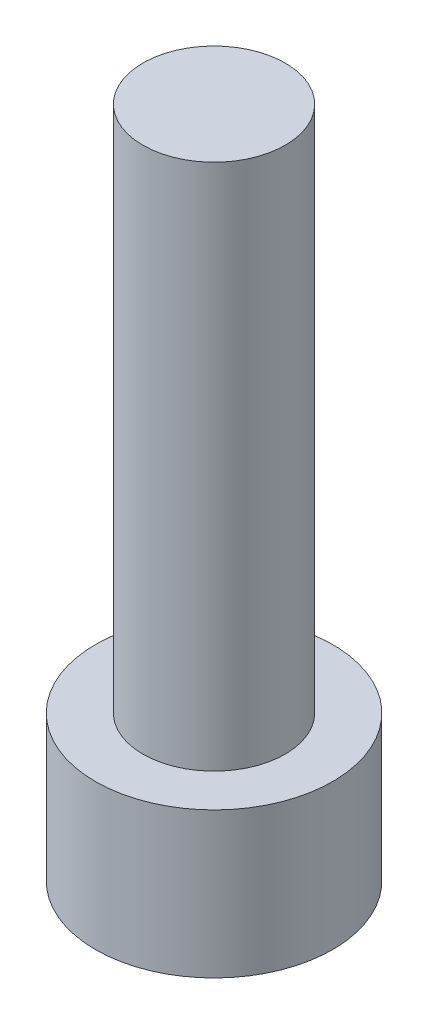
ISO-10303-21;
HEADER;
FILE_DESCRIPTION(('STEP AP214'),'2;1');
FILE_NAME('part.step','',(''),(''),'','','');
FILE_SCHEMA(('AUTOMOTIVE_DESIGN { 1 0 10303 214 1 1 1 1 }'));
ENDSEC;
DATA;
#1=APPLICATION_CONTEXT('core data for automotive mechanical design processes');
#2=APPLICATION_PROTOCOL_DEFINITION('international standard','automotive_design',2000,#1);
#3=PRODUCT_CONTEXT('',#1,'mechanical');
#4=PRODUCT('Part','Part','',(#3));
#5=PRODUCT_RELATED_PRODUCT_CATEGORY('part','',(#4));
#6=PRODUCT_DEFINITION_FORMATION('','',#4);
#7=PRODUCT_DEFINITION_CONTEXT('part definition',#1,'design');
#8=PRODUCT_DEFINITION('design','',#6,#7);
#9=PRODUCT_DEFINITION_SHAPE('','',#8);
#10=(LENGTH_UNIT() NAMED_UNIT(*) SI_UNIT(.MILLI.,.METRE.));
#11=(NAMED_UNIT(*) PLANE_ANGLE_UNIT() SI_UNIT($,.RADIAN.));
#12=(NAMED_UNIT(*) SI_UNIT($,.STERADIAN.) SOLID_ANGLE_UNIT());
#13=UNCERTAINTY_MEASURE_WITH_UNIT(LENGTH_MEASURE(1.E-05),#10,'distance_accuracy_value','');
#14=(GEOMETRIC_REPRESENTATION_CONTEXT(3) GLOBAL_UNCERTAINTY_ASSIGNED_CONTEXT((#13)) GLOBAL_UNIT_ASSIGNED_CONTEXT((#10,
#11,#12)) REPRESENTATION_CONTEXT('',''));
#15=CARTESIAN_POINT('',(0.,0.,0.));
#16=DIRECTION('',(0.,0.,1.));
#17=DIRECTION('',(1.,0.,0.));
#18=AXIS2_PLACEMENT_3D('',#15,#16,#17);
#19=CARTESIAN_POINT('',(0.,3.5052,0.));
#20=DIRECTION('',(0.,1.,0.));
#21=DIRECTION('',(0.,0.,1.));
#22=AXIS2_PLACEMENT_3D('',#19,#20,#21);
#23=PLANE('',#22);
#24=CARTESIAN_POINT('',(0.,3.5052,0.));
#25=DIRECTION('',(0.,1.,0.));
#26=DIRECTION('',(0.,0.,1.));
#27=AXIS2_PLACEMENT_3D('',#24,#25,#26);
#28=CIRCLE('',#27,2.8575);
#29=CARTESIAN_POINT('',(0.,3.5052,2.8575));
#30=VERTEX_POINT('',#29);
#31=EDGE_CURVE('E11',#30,#30,#28,.T.);
#32=ORIENTED_EDGE('',*,*,#31,.T.);
#33=EDGE_LOOP('',(#32));
#34=FACE_BOUND('',#33,.T.);
#35=CARTESIAN_POINT('',(0.,3.5052,0.));
#36=DIRECTION('',(0.,1.,0.));
#37=DIRECTION('',(0.,0.,1.));
#38=AXIS2_PLACEMENT_3D('',#35,#36,#37);
#39=CIRCLE('',#38,1.7145);
#40=CARTESIAN_POINT('',(0.,3.5052,1.7145));
#41=VERTEX_POINT('',#40);
#42=EDGE_CURVE('E152',#41,#41,#39,.T.);
#43=ORIENTED_EDGE('',*,*,#42,.F.);
#44=EDGE_LOOP('',(#43));
#45=FACE_BOUND('',#44,.T.);
#46=ADVANCED_FACE('F33',(#34,#45),#23,.T.);
#47=CARTESIAN_POINT('',(0.,3.5052,0.));
#48=DIRECTION('',(0.,-1.,0.));
#49=DIRECTION('',(0.,0.,-1.));
#50=AXIS2_PLACEMENT_3D('',#47,#48,#49);
#51=CYLINDRICAL_SURFACE('',#50,2.8575);
#52=ORIENTED_EDGE('',*,*,#31,.F.);
#53=EDGE_LOOP('',(#52));
#54=FACE_BOUND('',#53,.T.);
#55=CARTESIAN_POINT('',(0.,0.,0.));
#56=DIRECTION('',(0.,1.,0.));
#57=DIRECTION('',(0.,0.,1.));
#58=AXIS2_PLACEMENT_3D('',#55,#56,#57);
#59=CIRCLE('',#58,2.8575);
#60=CARTESIAN_POINT('',(0.,0.,2.8575));
#61=VERTEX_POINT('',#60);
#62=EDGE_CURVE('E37',#61,#61,#59,.T.);
#63=ORIENTED_EDGE('',*,*,#62,.T.);
#64=EDGE_LOOP('',(#63));
#65=FACE_BOUND('',#64,.T.);
#66=ADVANCED_FACE('F35',(#54,#65),#51,.T.);
#67=CARTESIAN_POINT('',(0.,0.,0.));
#68=DIRECTION('',(0.,1.,0.));
#69=DIRECTION('',(0.,0.,1.));
#70=AXIS2_PLACEMENT_3D('',#67,#68,#69);
#71=PLANE('',#70);
#72=DIRECTION('',(-0.500000000000001,0.,0.866025403784438));
#73=VECTOR('',#72,1.);
#74=CARTESIAN_POINT('',(1.60395121659243,0.,0.));
#75=LINE('',#74,#73);
#76=CARTESIAN_POINT('',(1.60395121659243,0.,0.));
#77=VERTEX_POINT('',#76);
#78=CARTESIAN_POINT('',(0.801975608296214,0.,1.3890625));
#79=VERTEX_POINT('',#78);
#80=EDGE_CURVE('E122',#77,#79,#75,.T.);
#81=ORIENTED_EDGE('',*,*,#80,.F.);
#82=DIRECTION('',(0.5,0.,0.866025403784439));
#83=VECTOR('',#82,1.);
#84=CARTESIAN_POINT('',(0.801975608296215,0.,-1.3890625));
#85=LINE('',#84,#83);
#86=CARTESIAN_POINT('',(0.801975608296215,0.,-1.3890625));
#87=VERTEX_POINT('',#86);
#88=EDGE_CURVE('E48',#87,#77,#85,.T.);
#89=ORIENTED_EDGE('',*,*,#88,.F.);
#90=DIRECTION('',(1.,0.,0.));
#91=VECTOR('',#90,1.);
#92=CARTESIAN_POINT('',(-0.801975608296214,0.,-1.3890625));
#93=LINE('',#92,#91);
#94=CARTESIAN_POINT('',(-0.801975608296214,0.,-1.3890625));
#95=VERTEX_POINT('',#94);
#96=EDGE_CURVE('E132',#95,#87,#93,.T.);
#97=ORIENTED_EDGE('',*,*,#96,.F.);
#98=DIRECTION('',(0.5,0.,-0.866025403784438));
#99=VECTOR('',#98,1.);
#100=CARTESIAN_POINT('',(-1.60395121659243,0.,0.));
#101=LINE('',#100,#99);
#102=CARTESIAN_POINT('',(-1.60395121659243,0.,0.));
#103=VERTEX_POINT('',#102);
#104=EDGE_CURVE('E130',#103,#95,#101,.T.);
#105=ORIENTED_EDGE('',*,*,#104,.F.);
#106=DIRECTION('',(-0.5,0.,-0.866025403784439));
#107=VECTOR('',#106,1.);
#108=CARTESIAN_POINT('',(-0.801975608296214,0.,1.3890625));
#109=LINE('',#108,#107);
#110=CARTESIAN_POINT('',(-0.801975608296214,0.,1.3890625));
#111=VERTEX_POINT('',#110);
#112=EDGE_CURVE('E96',#111,#103,#109,.T.);
#113=ORIENTED_EDGE('',*,*,#112,.F.);
#114=DIRECTION('',(-1.,0.,0.));
#115=VECTOR('',#114,1.);
#116=CARTESIAN_POINT('',(0.801975608296214,0.,1.3890625));
#117=LINE('',#116,#115);
#118=EDGE_CURVE('E126',#79,#111,#117,.T.);
#119=ORIENTED_EDGE('',*,*,#118,.F.);
#120=EDGE_LOOP('',(#81,#89,#97,#105,#113,#119));
#121=FACE_BOUND('',#120,.T.);
#122=ORIENTED_EDGE('',*,*,#62,.F.);
#123=EDGE_LOOP('',(#122));
#124=FACE_BOUND('',#123,.T.);
#125=ADVANCED_FACE('F145',(#121,#124),#71,.F.);
#126=CARTESIAN_POINT('',(0.801975608296215,1.9558,-1.3890625));
#127=DIRECTION('',(0.866025403784438,0.,-0.5));
#128=DIRECTION('',(-0.5,0.,-0.866025403784439));
#129=AXIS2_PLACEMENT_3D('',#126,#127,#128);
#130=PLANE('',#129);
#131=ORIENTED_EDGE('',*,*,#88,.T.);
#132=DIRECTION('',(0.,-1.,0.));
#133=VECTOR('',#132,1.);
#134=CARTESIAN_POINT('',(1.60395121659243,1.9558,0.));
#135=LINE('',#134,#133);
#136=CARTESIAN_POINT('',(1.60395121659243,1.9558,0.));
#137=VERTEX_POINT('',#136);
#138=EDGE_CURVE('E78',#137,#77,#135,.T.);
#139=ORIENTED_EDGE('',*,*,#138,.F.);
#140=DIRECTION('',(0.5,0.,0.866025403784439));
#141=VECTOR('',#140,1.);
#142=CARTESIAN_POINT('',(0.801975608296215,1.9558,-1.3890625));
#143=LINE('',#142,#141);
#144=CARTESIAN_POINT('',(0.801975608296215,1.9558,-1.3890625));
#145=VERTEX_POINT('',#144);
#146=EDGE_CURVE('E134',#145,#137,#143,.T.);
#147=ORIENTED_EDGE('',*,*,#146,.F.);
#148=DIRECTION('',(0.,-1.,0.));
#149=VECTOR('',#148,1.);
#150=CARTESIAN_POINT('',(0.801975608296215,1.9558,-1.3890625));
#151=LINE('',#150,#149);
#152=EDGE_CURVE('E56',#145,#87,#151,.T.);
#153=ORIENTED_EDGE('',*,*,#152,.T.);
#154=EDGE_LOOP('',(#131,#139,#147,#153));
#155=FACE_BOUND('',#154,.T.);
#156=ADVANCED_FACE('F174',(#155),#130,.F.);
#157=CARTESIAN_POINT('',(-0.801975608296214,1.9558,-1.3890625));
#158=DIRECTION('',(0.,0.,-1.));
#159=DIRECTION('',(-1.,0.,0.));
#160=AXIS2_PLACEMENT_3D('',#157,#158,#159);
#161=PLANE('',#160);
#162=ORIENTED_EDGE('',*,*,#96,.T.);
#163=ORIENTED_EDGE('',*,*,#152,.F.);
#164=DIRECTION('',(1.,0.,0.));
#165=VECTOR('',#164,1.);
#166=CARTESIAN_POINT('',(-0.801975608296214,1.9558,-1.3890625));
#167=LINE('',#166,#165);
#168=CARTESIAN_POINT('',(-0.801975608296214,1.9558,-1.3890625));
#169=VERTEX_POINT('',#168);
#170=EDGE_CURVE('E108',#169,#145,#167,.T.);
#171=ORIENTED_EDGE('',*,*,#170,.F.);
#172=DIRECTION('',(0.,-1.,0.));
#173=VECTOR('',#172,1.);
#174=CARTESIAN_POINT('',(-0.801975608296214,1.9558,-1.3890625));
#175=LINE('',#174,#173);
#176=EDGE_CURVE('E100',#169,#95,#175,.T.);
#177=ORIENTED_EDGE('',*,*,#176,.T.);
#178=EDGE_LOOP('',(#162,#163,#171,#177));
#179=FACE_BOUND('',#178,.T.);
#180=ADVANCED_FACE('F180',(#179),#161,.F.);
#181=CARTESIAN_POINT('',(-1.60395121659243,1.9558,0.));
#182=DIRECTION('',(-0.866025403784438,0.,-0.5));
#183=DIRECTION('',(-0.5,0.,0.866025403784439));
#184=AXIS2_PLACEMENT_3D('',#181,#182,#183);
#185=PLANE('',#184);
#186=ORIENTED_EDGE('',*,*,#104,.T.);
#187=ORIENTED_EDGE('',*,*,#176,.F.);
#188=DIRECTION('',(0.5,0.,-0.866025403784438));
#189=VECTOR('',#188,1.);
#190=CARTESIAN_POINT('',(-1.60395121659243,1.9558,0.));
#191=LINE('',#190,#189);
#192=CARTESIAN_POINT('',(-1.60395121659243,1.9558,0.));
#193=VERTEX_POINT('',#192);
#194=EDGE_CURVE('E104',#193,#169,#191,.T.);
#195=ORIENTED_EDGE('',*,*,#194,.F.);
#196=DIRECTION('',(0.,-1.,0.));
#197=VECTOR('',#196,1.);
#198=CARTESIAN_POINT('',(-1.60395121659243,1.9558,0.));
#199=LINE('',#198,#197);
#200=EDGE_CURVE('E89',#193,#103,#199,.T.);
#201=ORIENTED_EDGE('',*,*,#200,.T.);
#202=EDGE_LOOP('',(#186,#187,#195,#201));
#203=FACE_BOUND('',#202,.T.);
#204=ADVANCED_FACE('F105',(#203),#185,.F.);
#205=CARTESIAN_POINT('',(-0.801975608296214,1.9558,1.3890625));
#206=DIRECTION('',(-0.866025403784439,0.,0.5));
#207=DIRECTION('',(0.5,0.,0.866025403784439));
#208=AXIS2_PLACEMENT_3D('',#205,#206,#207);
#209=PLANE('',#208);
#210=ORIENTED_EDGE('',*,*,#112,.T.);
#211=ORIENTED_EDGE('',*,*,#200,.F.);
#212=DIRECTION('',(-0.5,0.,-0.866025403784439));
#213=VECTOR('',#212,1.);
#214=CARTESIAN_POINT('',(-0.801975608296214,1.9558,1.3890625));
#215=LINE('',#214,#213);
#216=CARTESIAN_POINT('',(-0.801975608296214,1.9558,1.3890625));
#217=VERTEX_POINT('',#216);
#218=EDGE_CURVE('E93',#217,#193,#215,.T.);
#219=ORIENTED_EDGE('',*,*,#218,.F.);
#220=DIRECTION('',(0.,-1.,0.));
#221=VECTOR('',#220,1.);
#222=CARTESIAN_POINT('',(-0.801975608296214,1.9558,1.3890625));
#223=LINE('',#222,#221);
#224=EDGE_CURVE('E101',#217,#111,#223,.T.);
#225=ORIENTED_EDGE('',*,*,#224,.T.);
#226=EDGE_LOOP('',(#210,#211,#219,#225));
#227=FACE_BOUND('',#226,.T.);
#228=ADVANCED_FACE('F91',(#227),#209,.F.);
#229=CARTESIAN_POINT('',(0.801975608296214,1.9558,1.3890625));
#230=DIRECTION('',(0.,0.,1.));
#231=DIRECTION('',(1.,0.,0.));
#232=AXIS2_PLACEMENT_3D('',#229,#230,#231);
#233=PLANE('',#232);
#234=ORIENTED_EDGE('',*,*,#118,.T.);
#235=ORIENTED_EDGE('',*,*,#224,.F.);
#236=DIRECTION('',(-1.,0.,0.));
#237=VECTOR('',#236,1.);
#238=CARTESIAN_POINT('',(0.801975608296214,1.9558,1.3890625));
#239=LINE('',#238,#237);
#240=CARTESIAN_POINT('',(0.801975608296214,1.9558,1.3890625));
#241=VERTEX_POINT('',#240);
#242=EDGE_CURVE('E114',#241,#217,#239,.T.);
#243=ORIENTED_EDGE('',*,*,#242,.F.);
#244=DIRECTION('',(0.,-1.,0.));
#245=VECTOR('',#244,1.);
#246=CARTESIAN_POINT('',(0.801975608296214,1.9558,1.3890625));
#247=LINE('',#246,#245);
#248=EDGE_CURVE('E138',#241,#79,#247,.T.);
#249=ORIENTED_EDGE('',*,*,#248,.T.);
#250=EDGE_LOOP('',(#234,#235,#243,#249));
#251=FACE_BOUND('',#250,.T.);
#252=ADVANCED_FACE('F149',(#251),#233,.F.);
#253=CARTESIAN_POINT('',(1.60395121659243,1.9558,0.));
#254=DIRECTION('',(0.866025403784438,0.,0.500000000000001));
#255=DIRECTION('',(0.500000000000001,0.,-0.866025403784438));
#256=AXIS2_PLACEMENT_3D('',#253,#254,#255);
#257=PLANE('',#256);
#258=ORIENTED_EDGE('',*,*,#80,.T.);
#259=ORIENTED_EDGE('',*,*,#248,.F.);
#260=DIRECTION('',(-0.500000000000001,0.,0.866025403784438));
#261=VECTOR('',#260,1.);
#262=CARTESIAN_POINT('',(1.60395121659243,1.9558,0.));
#263=LINE('',#262,#261);
#264=EDGE_CURVE('E116',#137,#241,#263,.T.);
#265=ORIENTED_EDGE('',*,*,#264,.F.);
#266=ORIENTED_EDGE('',*,*,#138,.T.);
#267=EDGE_LOOP('',(#258,#259,#265,#266));
#268=FACE_BOUND('',#267,.T.);
#269=ADVANCED_FACE('F142',(#268),#257,.F.);
#270=CARTESIAN_POINT('',(0.,1.9558,0.));
#271=DIRECTION('',(0.,-1.,0.));
#272=DIRECTION('',(0.,0.,-1.));
#273=AXIS2_PLACEMENT_3D('',#270,#271,#272);
#274=PLANE('',#273);
#275=ORIENTED_EDGE('',*,*,#146,.T.);
#276=ORIENTED_EDGE('',*,*,#264,.T.);
#277=ORIENTED_EDGE('',*,*,#242,.T.);
#278=ORIENTED_EDGE('',*,*,#218,.T.);
#279=ORIENTED_EDGE('',*,*,#194,.T.);
#280=ORIENTED_EDGE('',*,*,#170,.T.);
#281=EDGE_LOOP('',(#275,#276,#277,#278,#279,#280));
#282=FACE_BOUND('',#281,.T.);
#283=ADVANCED_FACE('F111',(#282),#274,.T.);
#284=CARTESIAN_POINT('',(0.,16.2052,0.));
#285=DIRECTION('',(0.,-1.,0.));
#286=DIRECTION('',(0.,0.,-1.));
#287=AXIS2_PLACEMENT_3D('',#284,#285,#286);
#288=CYLINDRICAL_SURFACE('',#287,1.7145);
#289=CARTESIAN_POINT('',(0.,16.2052,0.));
#290=DIRECTION('',(0.,1.,0.));
#291=DIRECTION('',(0.,0.,1.));
#292=AXIS2_PLACEMENT_3D('',#289,#290,#291);
#293=CIRCLE('',#292,1.7145);
#294=CARTESIAN_POINT('',(0.,16.2052,1.7145));
#295=VERTEX_POINT('',#294);
#296=EDGE_CURVE('E123',#295,#295,#293,.T.);
#297=ORIENTED_EDGE('',*,*,#296,.F.);
#298=EDGE_LOOP('',(#297));
#299=FACE_BOUND('',#298,.T.);
#300=ORIENTED_EDGE('',*,*,#42,.T.);
#301=EDGE_LOOP('',(#300));
#302=FACE_BOUND('',#301,.T.);
#303=ADVANCED_FACE('F160',(#299,#302),#288,.T.);
#304=CARTESIAN_POINT('',(0.,16.2052,0.));
#305=DIRECTION('',(0.,1.,0.));
#306=DIRECTION('',(0.,0.,1.));
#307=AXIS2_PLACEMENT_3D('',#304,#305,#306);
#308=PLANE('',#307);
#309=ORIENTED_EDGE('',*,*,#296,.T.);
#310=EDGE_LOOP('',(#309));
#311=FACE_BOUND('',#310,.T.);
#312=ADVANCED_FACE('F158',(#311),#308,.T.);
#313=CLOSED_SHELL('',(#46,#66,#125,#156,#180,#204,#228,#252,#269,#283,#303,#312));
#314=MANIFOLD_SOLID_BREP('B2',#313);
#315=ADVANCED_BREP_SHAPE_REPRESENTATION('',(#18,#314),#14);
#316=SHAPE_DEFINITION_REPRESENTATION(#9,#315);
ENDSEC;
END-ISO-10303-21;
